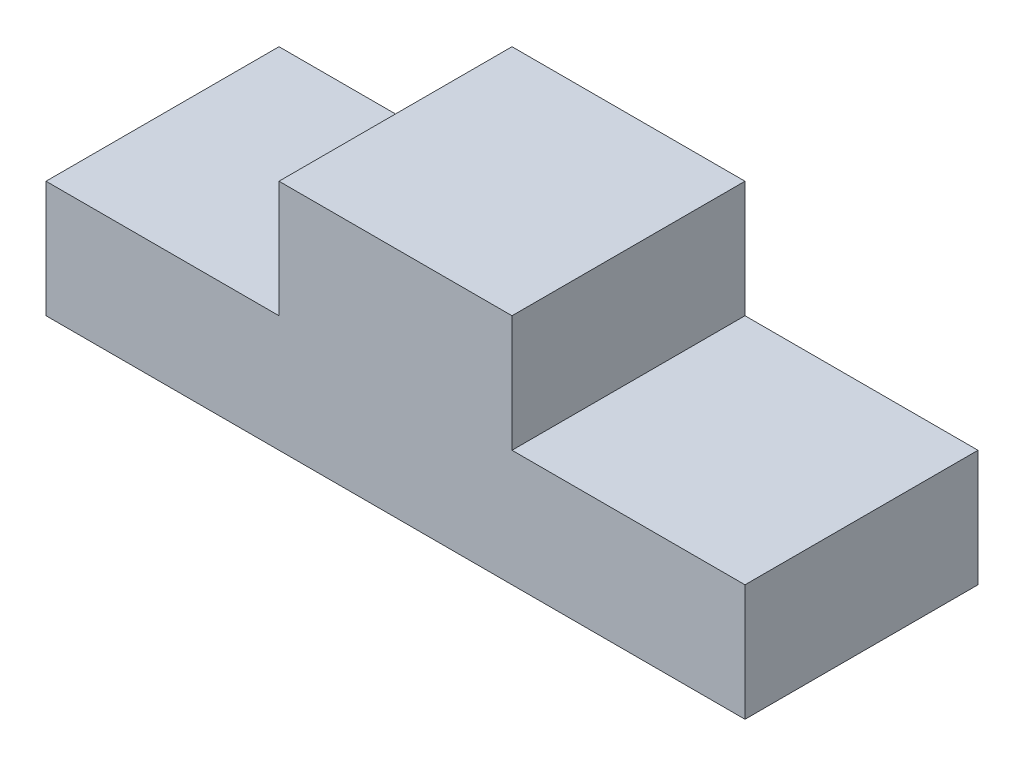
ISO-10303-21;
HEADER;
FILE_DESCRIPTION(('STEP AP214'),'2;1');
FILE_NAME('part.step','',(''),(''),'','','');
FILE_SCHEMA(('AUTOMOTIVE_DESIGN { 1 0 10303 214 1 1 1 1 }'));
ENDSEC;
DATA;
#1=APPLICATION_CONTEXT('core data for automotive mechanical design processes');
#2=APPLICATION_PROTOCOL_DEFINITION('international standard','automotive_design',2000,#1);
#3=PRODUCT_CONTEXT('',#1,'mechanical');
#4=PRODUCT('Part','Part','',(#3));
#5=PRODUCT_RELATED_PRODUCT_CATEGORY('part','',(#4));
#6=PRODUCT_DEFINITION_FORMATION('','',#4);
#7=PRODUCT_DEFINITION_CONTEXT('part definition',#1,'design');
#8=PRODUCT_DEFINITION('design','',#6,#7);
#9=PRODUCT_DEFINITION_SHAPE('','',#8);
#10=(LENGTH_UNIT() NAMED_UNIT(*) SI_UNIT(.MILLI.,.METRE.));
#11=(NAMED_UNIT(*) PLANE_ANGLE_UNIT() SI_UNIT($,.RADIAN.));
#12=(NAMED_UNIT(*) SI_UNIT($,.STERADIAN.) SOLID_ANGLE_UNIT());
#13=UNCERTAINTY_MEASURE_WITH_UNIT(LENGTH_MEASURE(1.E-05),#10,'distance_accuracy_value','');
#14=(GEOMETRIC_REPRESENTATION_CONTEXT(3) GLOBAL_UNCERTAINTY_ASSIGNED_CONTEXT((#13)) GLOBAL_UNIT_ASSIGNED_CONTEXT((#10,
#11,#12)) REPRESENTATION_CONTEXT('',''));
#15=CARTESIAN_POINT('',(0.,0.,0.));
#16=DIRECTION('',(0.,0.,1.));
#17=DIRECTION('',(1.,0.,0.));
#18=AXIS2_PLACEMENT_3D('',#15,#16,#17);
#19=CARTESIAN_POINT('',(0.,0.,-25.4));
#20=DIRECTION('',(-1.,0.,0.));
#21=DIRECTION('',(0.,0.,1.));
#22=AXIS2_PLACEMENT_3D('',#19,#20,#21);
#23=PLANE('',#22);
#24=DIRECTION('',(0.,-1.,0.));
#25=VECTOR('',#24,1.);
#26=CARTESIAN_POINT('',(0.,0.,0.));
#27=LINE('',#26,#25);
#28=CARTESIAN_POINT('',(0.,12.7,0.));
#29=VERTEX_POINT('',#28);
#30=CARTESIAN_POINT('',(0.,0.,0.));
#31=VERTEX_POINT('',#30);
#32=EDGE_CURVE('E142',#29,#31,#27,.T.);
#33=ORIENTED_EDGE('',*,*,#32,.F.);
#34=DIRECTION('',(0.,0.,1.));
#35=VECTOR('',#34,1.);
#36=CARTESIAN_POINT('',(0.,12.7,-25.4));
#37=LINE('',#36,#35);
#38=CARTESIAN_POINT('',(0.,12.7,-25.4));
#39=VERTEX_POINT('',#38);
#40=EDGE_CURVE('E11',#39,#29,#37,.T.);
#41=ORIENTED_EDGE('',*,*,#40,.F.);
#42=DIRECTION('',(0.,-1.,0.));
#43=VECTOR('',#42,1.);
#44=CARTESIAN_POINT('',(0.,0.,-25.4));
#45=LINE('',#44,#43);
#46=CARTESIAN_POINT('',(0.,0.,-25.4));
#47=VERTEX_POINT('',#46);
#48=EDGE_CURVE('E170',#39,#47,#45,.T.);
#49=ORIENTED_EDGE('',*,*,#48,.T.);
#50=DIRECTION('',(0.,0.,1.));
#51=VECTOR('',#50,1.);
#52=CARTESIAN_POINT('',(0.,0.,-25.4));
#53=LINE('',#52,#51);
#54=EDGE_CURVE('E42',#47,#31,#53,.T.);
#55=ORIENTED_EDGE('',*,*,#54,.T.);
#56=EDGE_LOOP('',(#33,#41,#49,#55));
#57=FACE_BOUND('',#56,.T.);
#58=ADVANCED_FACE('F39',(#57),#23,.T.);
#59=CARTESIAN_POINT('',(0.,12.7,-25.4));
#60=DIRECTION('',(0.,1.,0.));
#61=DIRECTION('',(0.,0.,1.));
#62=AXIS2_PLACEMENT_3D('',#59,#60,#61);
#63=PLANE('',#62);
#64=DIRECTION('',(-1.,0.,0.));
#65=VECTOR('',#64,1.);
#66=CARTESIAN_POINT('',(0.,12.7,0.));
#67=LINE('',#66,#65);
#68=CARTESIAN_POINT('',(25.4,12.7,0.));
#69=VERTEX_POINT('',#68);
#70=EDGE_CURVE('E167',#69,#29,#67,.T.);
#71=ORIENTED_EDGE('',*,*,#70,.F.);
#72=DIRECTION('',(0.,0.,1.));
#73=VECTOR('',#72,1.);
#74=CARTESIAN_POINT('',(25.4,12.7,-25.4));
#75=LINE('',#74,#73);
#76=CARTESIAN_POINT('',(25.4,12.7,-25.4));
#77=VERTEX_POINT('',#76);
#78=EDGE_CURVE('E49',#77,#69,#75,.T.);
#79=ORIENTED_EDGE('',*,*,#78,.F.);
#80=DIRECTION('',(-1.,0.,0.));
#81=VECTOR('',#80,1.);
#82=CARTESIAN_POINT('',(0.,12.7,-25.4));
#83=LINE('',#82,#81);
#84=EDGE_CURVE('E128',#77,#39,#83,.T.);
#85=ORIENTED_EDGE('',*,*,#84,.T.);
#86=ORIENTED_EDGE('',*,*,#40,.T.);
#87=EDGE_LOOP('',(#71,#79,#85,#86));
#88=FACE_BOUND('',#87,.T.);
#89=ADVANCED_FACE('F188',(#88),#63,.T.);
#90=CARTESIAN_POINT('',(25.4,12.7,-25.4));
#91=DIRECTION('',(-1.,0.,0.));
#92=DIRECTION('',(0.,0.,1.));
#93=AXIS2_PLACEMENT_3D('',#90,#91,#92);
#94=PLANE('',#93);
#95=DIRECTION('',(0.,-1.,0.));
#96=VECTOR('',#95,1.);
#97=CARTESIAN_POINT('',(25.4,12.7,0.));
#98=LINE('',#97,#96);
#99=CARTESIAN_POINT('',(25.4,25.4,0.));
#100=VERTEX_POINT('',#99);
#101=EDGE_CURVE('E114',#100,#69,#98,.T.);
#102=ORIENTED_EDGE('',*,*,#101,.F.);
#103=DIRECTION('',(0.,0.,1.));
#104=VECTOR('',#103,1.);
#105=CARTESIAN_POINT('',(25.4,25.4,-25.4));
#106=LINE('',#105,#104);
#107=CARTESIAN_POINT('',(25.4,25.4,-25.4));
#108=VERTEX_POINT('',#107);
#109=EDGE_CURVE('E109',#108,#100,#106,.T.);
#110=ORIENTED_EDGE('',*,*,#109,.F.);
#111=DIRECTION('',(0.,-1.,0.));
#112=VECTOR('',#111,1.);
#113=CARTESIAN_POINT('',(25.4,12.7,-25.4));
#114=LINE('',#113,#112);
#115=EDGE_CURVE('E112',#108,#77,#114,.T.);
#116=ORIENTED_EDGE('',*,*,#115,.T.);
#117=ORIENTED_EDGE('',*,*,#78,.T.);
#118=EDGE_LOOP('',(#102,#110,#116,#117));
#119=FACE_BOUND('',#118,.T.);
#120=ADVANCED_FACE('F111',(#119),#94,.T.);
#121=CARTESIAN_POINT('',(25.4,25.4,-25.4));
#122=DIRECTION('',(0.,1.,0.));
#123=DIRECTION('',(0.,0.,1.));
#124=AXIS2_PLACEMENT_3D('',#121,#122,#123);
#125=PLANE('',#124);
#126=DIRECTION('',(-1.,0.,0.));
#127=VECTOR('',#126,1.);
#128=CARTESIAN_POINT('',(25.4,25.4,0.));
#129=LINE('',#128,#127);
#130=CARTESIAN_POINT('',(50.8,25.4,0.));
#131=VERTEX_POINT('',#130);
#132=EDGE_CURVE('E162',#131,#100,#129,.T.);
#133=ORIENTED_EDGE('',*,*,#132,.F.);
#134=DIRECTION('',(0.,0.,1.));
#135=VECTOR('',#134,1.);
#136=CARTESIAN_POINT('',(50.8,25.4,-25.4));
#137=LINE('',#136,#135);
#138=CARTESIAN_POINT('',(50.8,25.4,-25.4));
#139=VERTEX_POINT('',#138);
#140=EDGE_CURVE('E120',#139,#131,#137,.T.);
#141=ORIENTED_EDGE('',*,*,#140,.F.);
#142=DIRECTION('',(-1.,0.,0.));
#143=VECTOR('',#142,1.);
#144=CARTESIAN_POINT('',(25.4,25.4,-25.4));
#145=LINE('',#144,#143);
#146=EDGE_CURVE('E126',#139,#108,#145,.T.);
#147=ORIENTED_EDGE('',*,*,#146,.T.);
#148=ORIENTED_EDGE('',*,*,#109,.T.);
#149=EDGE_LOOP('',(#133,#141,#147,#148));
#150=FACE_BOUND('',#149,.T.);
#151=ADVANCED_FACE('F131',(#150),#125,.T.);
#152=CARTESIAN_POINT('',(50.8,25.4,-25.4));
#153=DIRECTION('',(1.,0.,0.));
#154=DIRECTION('',(0.,0.,-1.));
#155=AXIS2_PLACEMENT_3D('',#152,#153,#154);
#156=PLANE('',#155);
#157=DIRECTION('',(0.,1.,0.));
#158=VECTOR('',#157,1.);
#159=CARTESIAN_POINT('',(50.8,25.4,0.));
#160=LINE('',#159,#158);
#161=CARTESIAN_POINT('',(50.8,12.7,0.));
#162=VERTEX_POINT('',#161);
#163=EDGE_CURVE('E158',#162,#131,#160,.T.);
#164=ORIENTED_EDGE('',*,*,#163,.F.);
#165=DIRECTION('',(0.,0.,1.));
#166=VECTOR('',#165,1.);
#167=CARTESIAN_POINT('',(50.8,12.7,-25.4));
#168=LINE('',#167,#166);
#169=CARTESIAN_POINT('',(50.8,12.7,-25.4));
#170=VERTEX_POINT('',#169);
#171=EDGE_CURVE('E176',#170,#162,#168,.T.);
#172=ORIENTED_EDGE('',*,*,#171,.F.);
#173=DIRECTION('',(0.,1.,0.));
#174=VECTOR('',#173,1.);
#175=CARTESIAN_POINT('',(50.8,25.4,-25.4));
#176=LINE('',#175,#174);
#177=EDGE_CURVE('E133',#170,#139,#176,.T.);
#178=ORIENTED_EDGE('',*,*,#177,.T.);
#179=ORIENTED_EDGE('',*,*,#140,.T.);
#180=EDGE_LOOP('',(#164,#172,#178,#179));
#181=FACE_BOUND('',#180,.T.);
#182=ADVANCED_FACE('F201',(#181),#156,.T.);
#183=CARTESIAN_POINT('',(50.8,12.7,-25.4));
#184=DIRECTION('',(0.,1.,0.));
#185=DIRECTION('',(0.,0.,1.));
#186=AXIS2_PLACEMENT_3D('',#183,#184,#185);
#187=PLANE('',#186);
#188=DIRECTION('',(-1.,0.,0.));
#189=VECTOR('',#188,1.);
#190=CARTESIAN_POINT('',(50.8,12.7,0.));
#191=LINE('',#190,#189);
#192=CARTESIAN_POINT('',(76.2,12.7,0.));
#193=VERTEX_POINT('',#192);
#194=EDGE_CURVE('E154',#193,#162,#191,.T.);
#195=ORIENTED_EDGE('',*,*,#194,.F.);
#196=DIRECTION('',(0.,0.,1.));
#197=VECTOR('',#196,1.);
#198=CARTESIAN_POINT('',(76.2,12.7,-25.4));
#199=LINE('',#198,#197);
#200=CARTESIAN_POINT('',(76.2,12.7,-25.4));
#201=VERTEX_POINT('',#200);
#202=EDGE_CURVE('E179',#201,#193,#199,.T.);
#203=ORIENTED_EDGE('',*,*,#202,.F.);
#204=DIRECTION('',(-1.,0.,0.));
#205=VECTOR('',#204,1.);
#206=CARTESIAN_POINT('',(50.8,12.7,-25.4));
#207=LINE('',#206,#205);
#208=EDGE_CURVE('E136',#201,#170,#207,.T.);
#209=ORIENTED_EDGE('',*,*,#208,.T.);
#210=ORIENTED_EDGE('',*,*,#171,.T.);
#211=EDGE_LOOP('',(#195,#203,#209,#210));
#212=FACE_BOUND('',#211,.T.);
#213=ADVANCED_FACE('F204',(#212),#187,.T.);
#214=CARTESIAN_POINT('',(76.2,0.,-25.4));
#215=DIRECTION('',(1.,0.,0.));
#216=DIRECTION('',(0.,0.,-1.));
#217=AXIS2_PLACEMENT_3D('',#214,#215,#216);
#218=PLANE('',#217);
#219=DIRECTION('',(0.,1.,0.));
#220=VECTOR('',#219,1.);
#221=CARTESIAN_POINT('',(76.2,0.,0.));
#222=LINE('',#221,#220);
#223=CARTESIAN_POINT('',(76.2,0.,0.));
#224=VERTEX_POINT('',#223);
#225=EDGE_CURVE('E150',#224,#193,#222,.T.);
#226=ORIENTED_EDGE('',*,*,#225,.F.);
#227=DIRECTION('',(0.,0.,1.));
#228=VECTOR('',#227,1.);
#229=CARTESIAN_POINT('',(76.2,0.,-25.4));
#230=LINE('',#229,#228);
#231=CARTESIAN_POINT('',(76.2,0.,-25.4));
#232=VERTEX_POINT('',#231);
#233=EDGE_CURVE('E181',#232,#224,#230,.T.);
#234=ORIENTED_EDGE('',*,*,#233,.F.);
#235=DIRECTION('',(0.,1.,0.));
#236=VECTOR('',#235,1.);
#237=CARTESIAN_POINT('',(76.2,0.,-25.4));
#238=LINE('',#237,#236);
#239=EDGE_CURVE('E279',#232,#201,#238,.T.);
#240=ORIENTED_EDGE('',*,*,#239,.T.);
#241=ORIENTED_EDGE('',*,*,#202,.T.);
#242=EDGE_LOOP('',(#226,#234,#240,#241));
#243=FACE_BOUND('',#242,.T.);
#244=ADVANCED_FACE('F208',(#243),#218,.T.);
#245=CARTESIAN_POINT('',(0.,0.,-25.4));
#246=DIRECTION('',(0.,-1.,0.));
#247=DIRECTION('',(0.,0.,-1.));
#248=AXIS2_PLACEMENT_3D('',#245,#246,#247);
#249=PLANE('',#248);
#250=DIRECTION('',(1.,0.,0.));
#251=VECTOR('',#250,1.);
#252=CARTESIAN_POINT('',(0.,0.,0.));
#253=LINE('',#252,#251);
#254=EDGE_CURVE('E146',#31,#224,#253,.T.);
#255=ORIENTED_EDGE('',*,*,#254,.F.);
#256=ORIENTED_EDGE('',*,*,#54,.F.);
#257=DIRECTION('',(1.,0.,0.));
#258=VECTOR('',#257,1.);
#259=CARTESIAN_POINT('',(0.,0.,-25.4));
#260=LINE('',#259,#258);
#261=EDGE_CURVE('E282',#47,#232,#260,.T.);
#262=ORIENTED_EDGE('',*,*,#261,.T.);
#263=ORIENTED_EDGE('',*,*,#233,.T.);
#264=EDGE_LOOP('',(#255,#256,#262,#263));
#265=FACE_BOUND('',#264,.T.);
#266=ADVANCED_FACE('F185',(#265),#249,.T.);
#267=CARTESIAN_POINT('',(0.,0.,-25.4));
#268=DIRECTION('',(0.,0.,-1.));
#269=DIRECTION('',(-1.,0.,0.));
#270=AXIS2_PLACEMENT_3D('',#267,#268,#269);
#271=PLANE('',#270);
#272=ORIENTED_EDGE('',*,*,#48,.F.);
#273=ORIENTED_EDGE('',*,*,#84,.F.);
#274=ORIENTED_EDGE('',*,*,#115,.F.);
#275=ORIENTED_EDGE('',*,*,#146,.F.);
#276=ORIENTED_EDGE('',*,*,#177,.F.);
#277=ORIENTED_EDGE('',*,*,#208,.F.);
#278=ORIENTED_EDGE('',*,*,#239,.F.);
#279=ORIENTED_EDGE('',*,*,#261,.F.);
#280=EDGE_LOOP('',(#272,#273,#274,#275,#276,#277,#278,#279));
#281=FACE_BOUND('',#280,.T.);
#282=ADVANCED_FACE('F124',(#281),#271,.T.);
#283=CARTESIAN_POINT('',(0.,0.,0.));
#284=DIRECTION('',(0.,0.,-1.));
#285=DIRECTION('',(-1.,0.,0.));
#286=AXIS2_PLACEMENT_3D('',#283,#284,#285);
#287=PLANE('',#286);
#288=ORIENTED_EDGE('',*,*,#32,.T.);
#289=ORIENTED_EDGE('',*,*,#254,.T.);
#290=ORIENTED_EDGE('',*,*,#225,.T.);
#291=ORIENTED_EDGE('',*,*,#194,.T.);
#292=ORIENTED_EDGE('',*,*,#163,.T.);
#293=ORIENTED_EDGE('',*,*,#132,.T.);
#294=ORIENTED_EDGE('',*,*,#101,.T.);
#295=ORIENTED_EDGE('',*,*,#70,.T.);
#296=EDGE_LOOP('',(#288,#289,#290,#291,#292,#293,#294,#295));
#297=FACE_BOUND('',#296,.T.);
#298=ADVANCED_FACE('F187',(#297),#287,.F.);
#299=CLOSED_SHELL('',(#58,#89,#120,#151,#182,#213,#244,#266,#282,#298));
#300=MANIFOLD_SOLID_BREP('B2',#299);
#301=ADVANCED_BREP_SHAPE_REPRESENTATION('',(#18,#300),#14);
#302=SHAPE_DEFINITION_REPRESENTATION(#9,#301);
ENDSEC;
END-ISO-10303-21;
